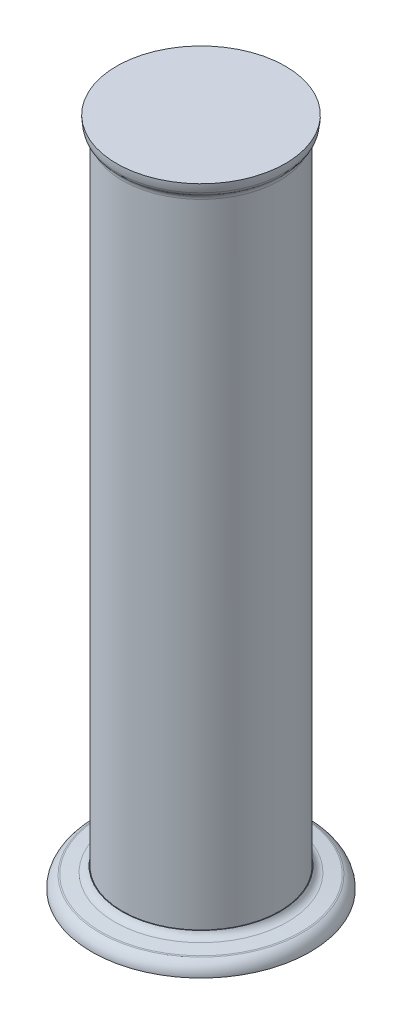
ISO-10303-21;
HEADER;
FILE_DESCRIPTION(('STEP AP214'),'2;1');
FILE_NAME('part.step','',(''),(''),'','','');
FILE_SCHEMA(('AUTOMOTIVE_DESIGN { 1 0 10303 214 1 1 1 1 }'));
ENDSEC;
DATA;
#1=APPLICATION_CONTEXT('core data for automotive mechanical design processes');
#2=APPLICATION_PROTOCOL_DEFINITION('international standard','automotive_design',2000,#1);
#3=PRODUCT_CONTEXT('',#1,'mechanical');
#4=PRODUCT('Part','Part','',(#3));
#5=PRODUCT_RELATED_PRODUCT_CATEGORY('part','',(#4));
#6=PRODUCT_DEFINITION_FORMATION('','',#4);
#7=PRODUCT_DEFINITION_CONTEXT('part definition',#1,'design');
#8=PRODUCT_DEFINITION('design','',#6,#7);
#9=PRODUCT_DEFINITION_SHAPE('','',#8);
#10=(LENGTH_UNIT() NAMED_UNIT(*) SI_UNIT(.MILLI.,.METRE.));
#11=(NAMED_UNIT(*) PLANE_ANGLE_UNIT() SI_UNIT($,.RADIAN.));
#12=(NAMED_UNIT(*) SI_UNIT($,.STERADIAN.) SOLID_ANGLE_UNIT());
#13=UNCERTAINTY_MEASURE_WITH_UNIT(LENGTH_MEASURE(1.E-05),#10,'distance_accuracy_value','');
#14=(GEOMETRIC_REPRESENTATION_CONTEXT(3) GLOBAL_UNCERTAINTY_ASSIGNED_CONTEXT((#13)) GLOBAL_UNIT_ASSIGNED_CONTEXT((#10,
#11,#12)) REPRESENTATION_CONTEXT('',''));
#15=CARTESIAN_POINT('',(0.,0.,0.));
#16=DIRECTION('',(0.,0.,1.));
#17=DIRECTION('',(1.,0.,0.));
#18=AXIS2_PLACEMENT_3D('',#15,#16,#17);
#19=CARTESIAN_POINT('',(-3.29577813896613E-12,213.800000000003,251.000000000001));
#20=DIRECTION('',(0.,-1.,0.));
#21=DIRECTION('',(0.,0.,1.));
#22=AXIS2_PLACEMENT_3D('',#19,#20,#21);
#23=PLANE('',#22);
#24=CARTESIAN_POINT('',(-3.29766225910432E-12,213.800000000003,176.000000000001));
#25=DIRECTION('',(0.,-1.,0.));
#26=DIRECTION('',(0.,0.,-1.));
#27=AXIS2_PLACEMENT_3D('',#24,#25,#26);
#28=CIRCLE('',#27,75.);
#29=CARTESIAN_POINT('',(-3.29766225910432E-12,213.800000000003,101.000000000001));
#30=VERTEX_POINT('',#29);
#31=EDGE_CURVE('E37',#30,#30,#28,.T.);
#32=ORIENTED_EDGE('',*,*,#31,.T.);
#33=EDGE_LOOP('',(#32));
#34=FACE_BOUND('',#33,.T.);
#35=ADVANCED_FACE('F34',(#34),#23,.T.);
#36=CARTESIAN_POINT('',(-3.29766225910432E-12,213.800000000003,176.000000000001));
#37=DIRECTION('',(0.,1.,0.));
#38=DIRECTION('',(0.,0.,-1.));
#39=AXIS2_PLACEMENT_3D('',#36,#37,#38);
#40=TOROIDAL_SURFACE('',#39,65.5989529684485,9.40104703155155);
#41=CARTESIAN_POINT('',(-3.29781962002054E-12,222.366147078511,176.000000000001));
#42=DIRECTION('',(0.,-1.,0.));
#43=DIRECTION('',(0.,0.,-1.));
#44=AXIS2_PLACEMENT_3D('',#41,#42,#43);
#45=CIRCLE('',#44,69.4720408216769);
#46=CARTESIAN_POINT('',(-3.29781962002054E-12,222.366147078511,106.527959178324));
#47=VERTEX_POINT('',#46);
#48=EDGE_CURVE('E83',#47,#47,#45,.T.);
#49=ORIENTED_EDGE('',*,*,#48,.T.);
#50=EDGE_LOOP('',(#49));
#51=FACE_BOUND('',#50,.T.);
#52=ORIENTED_EDGE('',*,*,#31,.F.);
#53=EDGE_LOOP('',(#52));
#54=FACE_BOUND('',#53,.T.);
#55=ADVANCED_FACE('F92',(#51,#54),#40,.T.);
#56=CARTESIAN_POINT('',(-3.29781962002054E-12,219.780358568721,176.000000000001));
#57=DIRECTION('',(0.,1.,0.));
#58=DIRECTION('',(0.,0.,-1.));
#59=AXIS2_PLACEMENT_3D('',#56,#57,#58);
#60=TOROIDAL_SURFACE('',#59,68.3029053893175,2.83781251610467);
#61=CARTESIAN_POINT('',(-3.30202314347965E-12,222.59701846066,176.000000000001));
#62=DIRECTION('',(0.,1.,0.));
#63=DIRECTION('',(0.,0.,-1.));
#64=AXIS2_PLACEMENT_3D('',#61,#62,#63);
#65=CIRCLE('',#64,68.6487477373621);
#66=CARTESIAN_POINT('',(-3.30773930000587E-12,222.59701846066,107.351252262639));
#67=VERTEX_POINT('',#66);
#68=EDGE_CURVE('E80',#67,#67,#65,.F.);
#69=ORIENTED_EDGE('',*,*,#68,.T.);
#70=EDGE_LOOP('',(#69));
#71=FACE_BOUND('',#70,.T.);
#72=ORIENTED_EDGE('',*,*,#48,.F.);
#73=EDGE_LOOP('',(#72));
#74=FACE_BOUND('',#73,.T.);
#75=ADVANCED_FACE('F88',(#71,#74),#60,.T.);
#76=CARTESIAN_POINT('',(-3.29719371126791E-12,674.400000000003,233.999544291101));
#77=DIRECTION('',(0.,1.,0.));
#78=DIRECTION('',(0.,0.,-1.));
#79=AXIS2_PLACEMENT_3D('',#76,#77,#78);
#80=PLANE('',#79);
#81=CARTESIAN_POINT('',(-3.29847169566624E-12,674.400000000003,176.000000000001));
#82=DIRECTION('',(0.,-1.,0.));
#83=DIRECTION('',(0.,0.,-1.));
#84=AXIS2_PLACEMENT_3D('',#81,#82,#83);
#85=CIRCLE('',#84,57.9995442910995);
#86=CARTESIAN_POINT('',(-3.29847169566624E-12,674.400000000003,118.000455708902));
#87=VERTEX_POINT('',#86);
#88=EDGE_CURVE('E77',#87,#87,#85,.F.);
#89=ORIENTED_EDGE('',*,*,#88,.T.);
#90=EDGE_LOOP('',(#89));
#91=FACE_BOUND('',#90,.T.);
#92=ADVANCED_FACE('F91',(#91),#80,.T.);
#93=CARTESIAN_POINT('',(-3.30202314347965E-12,222.59701846066,176.000000000001));
#94=DIRECTION('',(0.,-1.,0.));
#95=DIRECTION('',(0.,0.,1.));
#96=AXIS2_PLACEMENT_3D('',#93,#94,#95);
#97=CONICAL_SURFACE('',#96,68.6487477373623,1.4486232791553);
#98=ORIENTED_EDGE('',*,*,#68,.F.);
#99=EDGE_LOOP('',(#98));
#100=FACE_BOUND('',#99,.T.);
#101=CARTESIAN_POINT('',(-3.30565230980669E-12,223.748733196857,176.000000000001));
#102=DIRECTION('',(0.,-1.,0.));
#103=DIRECTION('',(0.,0.,-1.));
#104=AXIS2_PLACEMENT_3D('',#101,#102,#103);
#105=CIRCLE('',#104,59.2687839395692);
#106=CARTESIAN_POINT('',(-3.30565230980669E-12,223.748733196857,116.731216060432));
#107=VERTEX_POINT('',#106);
#108=EDGE_CURVE('E75',#107,#107,#105,.F.);
#109=ORIENTED_EDGE('',*,*,#108,.F.);
#110=EDGE_LOOP('',(#109));
#111=FACE_BOUND('',#110,.T.);
#112=ADVANCED_FACE('F108',(#100,#111),#97,.T.);
#113=CARTESIAN_POINT('',(-3.29847169566624E-12,674.548999036331,176.000000000001));
#114=DIRECTION('',(0.,1.,0.));
#115=DIRECTION('',(0.,0.,-1.));
#116=AXIS2_PLACEMENT_3D('',#113,#114,#115);
#117=TOROIDAL_SURFACE('',#116,33.642434735737,24.3575652848301);
#118=ORIENTED_EDGE('',*,*,#88,.F.);
#119=EDGE_LOOP('',(#118));
#120=FACE_BOUND('',#119,.T.);
#121=CARTESIAN_POINT('',(-3.29851886267183E-12,668.470084925447,176.000000000001));
#122=DIRECTION('',(0.,-1.,0.));
#123=DIRECTION('',(0.,0.,-1.));
#124=AXIS2_PLACEMENT_3D('',#121,#122,#123);
#125=CIRCLE('',#124,57.2292486332781);
#126=CARTESIAN_POINT('',(-3.29851886267183E-12,668.470084925447,118.770751366723));
#127=VERTEX_POINT('',#126);
#128=EDGE_CURVE('E54',#127,#127,#125,.F.);
#129=ORIENTED_EDGE('',*,*,#128,.T.);
#130=EDGE_LOOP('',(#129));
#131=FACE_BOUND('',#130,.T.);
#132=ADVANCED_FACE('F68',(#120,#131),#117,.T.);
#133=CARTESIAN_POINT('',(-3.30547800626991E-12,229.704010106705,176.000000000001));
#134=DIRECTION('',(0.,1.,0.));
#135=DIRECTION('',(0.,0.,-1.));
#136=AXIS2_PLACEMENT_3D('',#133,#134,#135);
#137=TOROIDAL_SURFACE('',#136,60.,6.00000000000001);
#138=ORIENTED_EDGE('',*,*,#108,.T.);
#139=EDGE_LOOP('',(#138));
#140=FACE_BOUND('',#139,.T.);
#141=CARTESIAN_POINT('',(-3.3055410530962E-12,227.549944183851,176.000000000001));
#142=DIRECTION('',(0.,-1.,0.));
#143=DIRECTION('',(0.,0.,-1.));
#144=AXIS2_PLACEMENT_3D('',#141,#142,#143);
#145=CIRCLE('',#144,54.4);
#146=CARTESIAN_POINT('',(-3.3055410530962E-12,227.549944183851,121.600000000001));
#147=VERTEX_POINT('',#146);
#148=EDGE_CURVE('E100',#147,#147,#145,.T.);
#149=ORIENTED_EDGE('',*,*,#148,.T.);
#150=EDGE_LOOP('',(#149));
#151=FACE_BOUND('',#150,.T.);
#152=ADVANCED_FACE('F62',(#140,#151),#137,.F.);
#153=CARTESIAN_POINT('',(-3.29851886267183E-12,669.71793421576,176.000000000001));
#154=DIRECTION('',(0.,1.,0.));
#155=DIRECTION('',(0.,0.,-1.));
#156=AXIS2_PLACEMENT_3D('',#153,#154,#155);
#157=TOROIDAL_SURFACE('',#156,52.3874646491793,5.00000000000109);
#158=ORIENTED_EDGE('',*,*,#128,.F.);
#159=EDGE_LOOP('',(#158));
#160=FACE_BOUND('',#159,.T.);
#161=CARTESIAN_POINT('',(-3.30328899422403E-12,666.220594287331,176.000000000001));
#162=DIRECTION('',(0.,-1.,0.));
#163=DIRECTION('',(-1.,0.,0.));
#164=AXIS2_PLACEMENT_3D('',#161,#162,#163);
#165=CIRCLE('',#164,55.9607843137254);
#166=CARTESIAN_POINT('',(-55.9607843137287,666.220594287331,176.000000000001));
#167=VERTEX_POINT('',#166);
#168=EDGE_CURVE('E46',#167,#167,#165,.T.);
#169=ORIENTED_EDGE('',*,*,#168,.F.);
#170=EDGE_LOOP('',(#169));
#171=FACE_BOUND('',#170,.T.);
#172=ADVANCED_FACE('F57',(#160,#171),#157,.T.);
#173=CARTESIAN_POINT('',(-3.29749343353917E-12,227.549944183851,230.400000000001));
#174=DIRECTION('',(0.,1.,0.));
#175=DIRECTION('',(0.,0.,-1.));
#176=AXIS2_PLACEMENT_3D('',#173,#174,#175);
#177=PLANE('',#176);
#178=CARTESIAN_POINT('',(-3.30202314347965E-12,227.549944183851,176.000000000001));
#179=DIRECTION('',(0.,1.,0.));
#180=DIRECTION('',(0.,0.,1.));
#181=AXIS2_PLACEMENT_3D('',#178,#179,#180);
#182=CIRCLE('',#181,54.);
#183=CARTESIAN_POINT('',(-3.30202314347965E-12,227.549944183851,230.000000000001));
#184=VERTEX_POINT('',#183);
#185=EDGE_CURVE('E41',#184,#184,#182,.F.);
#186=ORIENTED_EDGE('',*,*,#185,.T.);
#187=EDGE_LOOP('',(#186));
#188=FACE_BOUND('',#187,.T.);
#189=ORIENTED_EDGE('',*,*,#148,.F.);
#190=EDGE_LOOP('',(#189));
#191=FACE_BOUND('',#190,.T.);
#192=ADVANCED_FACE('F61',(#188,#191),#177,.T.);
#193=CARTESIAN_POINT('',(-3.30532968983734E-12,662.25030865374,176.000000000001));
#194=DIRECTION('',(0.,1.,0.));
#195=DIRECTION('',(-1.,0.,0.));
#196=AXIS2_PLACEMENT_3D('',#193,#194,#195);
#197=TOROIDAL_SURFACE('',#196,59.0000000000003,5.00000000000024);
#198=CARTESIAN_POINT('',(-3.30202314347965E-12,662.25030865374,176.000000000001));
#199=DIRECTION('',(0.,1.,0.));
#200=DIRECTION('',(0.,0.,1.));
#201=AXIS2_PLACEMENT_3D('',#198,#199,#200);
#202=CIRCLE('',#201,54.);
#203=CARTESIAN_POINT('',(-3.30202314347965E-12,662.25030865374,230.000000000001));
#204=VERTEX_POINT('',#203);
#205=EDGE_CURVE('E10',#204,#204,#202,.T.);
#206=ORIENTED_EDGE('',*,*,#205,.T.);
#207=EDGE_LOOP('',(#206));
#208=FACE_BOUND('',#207,.T.);
#209=ORIENTED_EDGE('',*,*,#168,.T.);
#210=EDGE_LOOP('',(#209));
#211=FACE_BOUND('',#210,.T.);
#212=ADVANCED_FACE('F117',(#208,#211),#197,.F.);
#213=CARTESIAN_POINT('',(-3.30202314347965E-12,213.800000000003,176.000000000001));
#214=DIRECTION('',(0.,-1.,0.));
#215=DIRECTION('',(0.,0.,1.));
#216=AXIS2_PLACEMENT_3D('',#213,#214,#215);
#217=CYLINDRICAL_SURFACE('',#216,54.);
#218=ORIENTED_EDGE('',*,*,#185,.F.);
#219=EDGE_LOOP('',(#218));
#220=FACE_BOUND('',#219,.T.);
#221=ORIENTED_EDGE('',*,*,#205,.F.);
#222=EDGE_LOOP('',(#221));
#223=FACE_BOUND('',#222,.T.);
#224=ADVANCED_FACE('F120',(#220,#223),#217,.T.);
#225=CLOSED_SHELL('',(#35,#55,#75,#92,#112,#132,#152,#172,#192,#212,#224));
#226=MANIFOLD_SOLID_BREP('B2',#225);
#227=ADVANCED_BREP_SHAPE_REPRESENTATION('',(#18,#226),#14);
#228=SHAPE_DEFINITION_REPRESENTATION(#9,#227);
ENDSEC;
END-ISO-10303-21;
